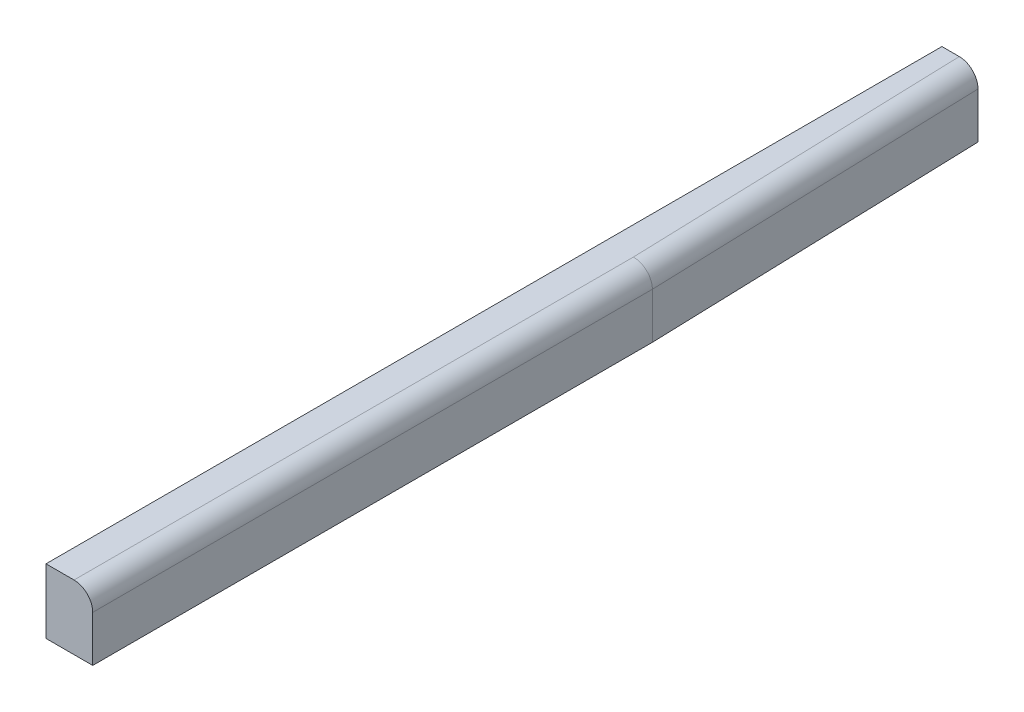
ISO-10303-21;
HEADER;
FILE_DESCRIPTION(('STEP AP214'),'2;1');
FILE_NAME('part.step','',(''),(''),'','','');
FILE_SCHEMA(('AUTOMOTIVE_DESIGN { 1 0 10303 214 1 1 1 1 }'));
ENDSEC;
DATA;
#1=APPLICATION_CONTEXT('core data for automotive mechanical design processes');
#2=APPLICATION_PROTOCOL_DEFINITION('international standard','automotive_design',2000,#1);
#3=PRODUCT_CONTEXT('',#1,'mechanical');
#4=PRODUCT('Part','Part','',(#3));
#5=PRODUCT_RELATED_PRODUCT_CATEGORY('part','',(#4));
#6=PRODUCT_DEFINITION_FORMATION('','',#4);
#7=PRODUCT_DEFINITION_CONTEXT('part definition',#1,'design');
#8=PRODUCT_DEFINITION('design','',#6,#7);
#9=PRODUCT_DEFINITION_SHAPE('','',#8);
#10=(LENGTH_UNIT() NAMED_UNIT(*) SI_UNIT(.MILLI.,.METRE.));
#11=(NAMED_UNIT(*) PLANE_ANGLE_UNIT() SI_UNIT($,.RADIAN.));
#12=(NAMED_UNIT(*) SI_UNIT($,.STERADIAN.) SOLID_ANGLE_UNIT());
#13=UNCERTAINTY_MEASURE_WITH_UNIT(LENGTH_MEASURE(1.E-05),#10,'distance_accuracy_value','');
#14=(GEOMETRIC_REPRESENTATION_CONTEXT(3) GLOBAL_UNCERTAINTY_ASSIGNED_CONTEXT((#13)) GLOBAL_UNIT_ASSIGNED_CONTEXT((#10,
#11,#12)) REPRESENTATION_CONTEXT('',''));
#15=CARTESIAN_POINT('',(0.,0.,0.));
#16=DIRECTION('',(0.,0.,1.));
#17=DIRECTION('',(1.,0.,0.));
#18=AXIS2_PLACEMENT_3D('',#15,#16,#17);
#19=CARTESIAN_POINT('',(37.211,37.211,25.4));
#20=DIRECTION('',(0.,0.,-1.));
#21=DIRECTION('',(-1.,0.,0.));
#22=AXIS2_PLACEMENT_3D('',#19,#20,#21);
#23=CYLINDRICAL_SURFACE('',#22,12.7);
#24=DIRECTION('',(0.,0.,-1.));
#25=VECTOR('',#24,1.);
#26=CARTESIAN_POINT('',(37.211,49.911,25.4));
#27=LINE('',#26,#25);
#28=CARTESIAN_POINT('',(37.211,49.911,24.511));
#29=VERTEX_POINT('',#28);
#30=CARTESIAN_POINT('',(37.211,49.911,-355.500431129882));
#31=VERTEX_POINT('',#30);
#32=EDGE_CURVE('E111',#29,#31,#27,.T.);
#33=ORIENTED_EDGE('',*,*,#32,.F.);
#34=CARTESIAN_POINT('',(37.211,37.211,24.511));
#35=DIRECTION('',(0.,0.,1.));
#36=DIRECTION('',(1.,0.,0.));
#37=AXIS2_PLACEMENT_3D('',#34,#35,#36);
#38=CIRCLE('',#37,12.7);
#39=CARTESIAN_POINT('',(49.911,37.211,24.511));
#40=VERTEX_POINT('',#39);
#41=EDGE_CURVE('E97',#29,#40,#38,.F.);
#42=ORIENTED_EDGE('',*,*,#41,.T.);
#43=DIRECTION('',(0.,0.,-1.));
#44=VECTOR('',#43,1.);
#45=CARTESIAN_POINT('',(49.911,37.211,25.4));
#46=LINE('',#45,#44);
#47=CARTESIAN_POINT('',(49.911,37.211,-355.7016));
#48=VERTEX_POINT('',#47);
#49=EDGE_CURVE('E129',#48,#40,#46,.F.);
#50=ORIENTED_EDGE('',*,*,#49,.F.);
#51=CARTESIAN_POINT('',(37.211,37.211,-355.50043112988));
#52=DIRECTION('',(-0.0158380816890187,0.,-0.999874569717828));
#53=DIRECTION('',(0.999874569717828,0.,-0.0158380816890164));
#54=AXIS2_PLACEMENT_3D('',#51,#52,#53);
#55=ELLIPSE('',#54,12.7015931644146,12.7);
#56=EDGE_CURVE('E118',#31,#48,#55,.T.);
#57=ORIENTED_EDGE('',*,*,#56,.F.);
#58=EDGE_LOOP('',(#33,#42,#50,#57));
#59=FACE_BOUND('',#58,.T.);
#60=ADVANCED_FACE('F43',(#59),#23,.T.);
#61=CARTESIAN_POINT('',(49.911,-49.911,25.4));
#62=DIRECTION('',(-1.,0.,0.));
#63=DIRECTION('',(0.,0.,1.));
#64=AXIS2_PLACEMENT_3D('',#61,#62,#63);
#65=PLANE('',#64);
#66=DIRECTION('',(0.,1.,0.));
#67=VECTOR('',#66,1.);
#68=CARTESIAN_POINT('',(49.911,-49.911,24.511));
#69=LINE('',#68,#67);
#70=CARTESIAN_POINT('',(49.911,5.96900000000002,24.511));
#71=VERTEX_POINT('',#70);
#72=EDGE_CURVE('E100',#71,#40,#69,.T.);
#73=ORIENTED_EDGE('',*,*,#72,.F.);
#74=DIRECTION('',(0.,0.,-1.));
#75=VECTOR('',#74,1.);
#76=CARTESIAN_POINT('',(49.911,5.96900000000002,25.4));
#77=LINE('',#76,#75);
#78=CARTESIAN_POINT('',(49.911,5.96900000000002,-355.7016));
#79=VERTEX_POINT('',#78);
#80=EDGE_CURVE('E132',#71,#79,#77,.T.);
#81=ORIENTED_EDGE('',*,*,#80,.T.);
#82=DIRECTION('',(0.,1.,0.));
#83=VECTOR('',#82,1.);
#84=CARTESIAN_POINT('',(49.911,-49.911,-355.7016));
#85=LINE('',#84,#83);
#86=EDGE_CURVE('E119',#79,#48,#85,.T.);
#87=ORIENTED_EDGE('',*,*,#86,.T.);
#88=ORIENTED_EDGE('',*,*,#49,.T.);
#89=EDGE_LOOP('',(#73,#81,#87,#88));
#90=FACE_BOUND('',#89,.T.);
#91=ADVANCED_FACE('F153',(#90),#65,.F.);
#92=CARTESIAN_POINT('',(0.,5.96900000000002,0.));
#93=DIRECTION('',(0.,1.,0.));
#94=DIRECTION('',(0.,0.,1.));
#95=AXIS2_PLACEMENT_3D('',#92,#93,#94);
#96=PLANE('',#95);
#97=DIRECTION('',(1.,0.,0.));
#98=VECTOR('',#97,1.);
#99=CARTESIAN_POINT('',(0.,5.96900000000002,24.511));
#100=LINE('',#99,#98);
#101=CARTESIAN_POINT('',(18.161,5.96900000000002,24.511));
#102=VERTEX_POINT('',#101);
#103=EDGE_CURVE('E114',#102,#71,#100,.T.);
#104=ORIENTED_EDGE('',*,*,#103,.F.);
#105=DIRECTION('',(0.,0.,1.));
#106=VECTOR('',#105,1.);
#107=CARTESIAN_POINT('',(18.161,5.96900000000002,0.));
#108=LINE('',#107,#106);
#109=CARTESIAN_POINT('',(18.161,5.96900000000002,-584.2));
#110=VERTEX_POINT('',#109);
#111=EDGE_CURVE('E134',#110,#102,#108,.T.);
#112=ORIENTED_EDGE('',*,*,#111,.F.);
#113=DIRECTION('',(1.,0.,0.));
#114=VECTOR('',#113,1.);
#115=CARTESIAN_POINT('',(0.,5.96900000000002,-584.2));
#116=LINE('',#115,#114);
#117=CARTESIAN_POINT('',(42.6703226354349,5.96900000000002,-584.2));
#118=VERTEX_POINT('',#117);
#119=EDGE_CURVE('E158',#110,#118,#116,.T.);
#120=ORIENTED_EDGE('',*,*,#119,.T.);
#121=DIRECTION('',(-0.0316721902279269,0.,-0.999498310336824));
#122=VECTOR('',#121,1.);
#123=CARTESIAN_POINT('',(61.1211296763861,5.96900000000002,-1.93681172447798));
#124=LINE('',#123,#122);
#125=EDGE_CURVE('E135',#79,#118,#124,.T.);
#126=ORIENTED_EDGE('',*,*,#125,.F.);
#127=ORIENTED_EDGE('',*,*,#80,.F.);
#128=EDGE_LOOP('',(#104,#112,#120,#126,#127));
#129=FACE_BOUND('',#128,.T.);
#130=ADVANCED_FACE('F155',(#129),#96,.F.);
#131=CARTESIAN_POINT('',(-49.911,49.911,25.4));
#132=DIRECTION('',(0.,-1.,0.));
#133=DIRECTION('',(0.,0.,-1.));
#134=AXIS2_PLACEMENT_3D('',#131,#132,#133);
#135=PLANE('',#134);
#136=DIRECTION('',(-1.,0.,0.));
#137=VECTOR('',#136,1.);
#138=CARTESIAN_POINT('',(-78.5898334013736,49.911,24.511));
#139=LINE('',#138,#137);
#140=CARTESIAN_POINT('',(18.161,49.911,24.511));
#141=VERTEX_POINT('',#140);
#142=EDGE_CURVE('E57',#29,#141,#139,.T.);
#143=ORIENTED_EDGE('',*,*,#142,.F.);
#144=ORIENTED_EDGE('',*,*,#32,.T.);
#145=DIRECTION('',(0.0316721902279269,0.,0.999498310336824));
#146=VECTOR('',#145,1.);
#147=CARTESIAN_POINT('',(49.1815040674601,49.911,22.2599480293983));
#148=LINE('',#147,#146);
#149=CARTESIAN_POINT('',(29.9639479786131,49.911,-584.2));
#150=VERTEX_POINT('',#149);
#151=EDGE_CURVE('E120',#31,#150,#148,.F.);
#152=ORIENTED_EDGE('',*,*,#151,.T.);
#153=DIRECTION('',(-1.,0.,0.));
#154=VECTOR('',#153,1.);
#155=CARTESIAN_POINT('',(-49.911,49.911,-584.2));
#156=LINE('',#155,#154);
#157=CARTESIAN_POINT('',(18.161,49.911,-584.2));
#158=VERTEX_POINT('',#157);
#159=EDGE_CURVE('E65',#150,#158,#156,.T.);
#160=ORIENTED_EDGE('',*,*,#159,.T.);
#161=DIRECTION('',(0.,0.,1.));
#162=VECTOR('',#161,1.);
#163=CARTESIAN_POINT('',(18.161,49.911,25.4));
#164=LINE('',#163,#162);
#165=EDGE_CURVE('E105',#158,#141,#164,.T.);
#166=ORIENTED_EDGE('',*,*,#165,.T.);
#167=EDGE_LOOP('',(#143,#144,#152,#160,#166));
#168=FACE_BOUND('',#167,.T.);
#169=ADVANCED_FACE('F109',(#168),#135,.F.);
#170=CARTESIAN_POINT('',(18.161,0.,0.));
#171=DIRECTION('',(1.,0.,0.));
#172=DIRECTION('',(0.,0.,-1.));
#173=AXIS2_PLACEMENT_3D('',#170,#171,#172);
#174=PLANE('',#173);
#175=DIRECTION('',(0.,-1.,0.));
#176=VECTOR('',#175,1.);
#177=CARTESIAN_POINT('',(18.161,0.,24.511));
#178=LINE('',#177,#176);
#179=EDGE_CURVE('E11',#141,#102,#178,.T.);
#180=ORIENTED_EDGE('',*,*,#179,.F.);
#181=ORIENTED_EDGE('',*,*,#165,.F.);
#182=DIRECTION('',(0.,-1.,0.));
#183=VECTOR('',#182,1.);
#184=CARTESIAN_POINT('',(18.161,0.,-584.2));
#185=LINE('',#184,#183);
#186=EDGE_CURVE('E165',#158,#110,#185,.T.);
#187=ORIENTED_EDGE('',*,*,#186,.T.);
#188=ORIENTED_EDGE('',*,*,#111,.T.);
#189=EDGE_LOOP('',(#180,#181,#187,#188));
#190=FACE_BOUND('',#189,.T.);
#191=ADVANCED_FACE('F168',(#190),#174,.F.);
#192=CARTESIAN_POINT('',(0.,0.,-584.2));
#193=DIRECTION('',(0.,0.,1.));
#194=DIRECTION('',(1.,0.,0.));
#195=AXIS2_PLACEMENT_3D('',#192,#193,#194);
#196=PLANE('',#195);
#197=CARTESIAN_POINT('',(29.9639479786131,37.211,-584.2));
#198=DIRECTION('',(0.,0.,1.));
#199=DIRECTION('',(1.,0.,0.));
#200=AXIS2_PLACEMENT_3D('',#197,#198,#199);
#201=ELLIPSE('',#200,12.7063746568218,12.7);
#202=CARTESIAN_POINT('',(42.6703226354349,37.211,-584.2));
#203=VERTEX_POINT('',#202);
#204=EDGE_CURVE('E51',#150,#203,#201,.F.);
#205=ORIENTED_EDGE('',*,*,#204,.T.);
#206=DIRECTION('',(0.,1.,0.));
#207=VECTOR('',#206,1.);
#208=CARTESIAN_POINT('',(42.6703226354349,0.,-584.2));
#209=LINE('',#208,#207);
#210=EDGE_CURVE('E138',#118,#203,#209,.T.);
#211=ORIENTED_EDGE('',*,*,#210,.F.);
#212=ORIENTED_EDGE('',*,*,#119,.F.);
#213=ORIENTED_EDGE('',*,*,#186,.F.);
#214=ORIENTED_EDGE('',*,*,#159,.F.);
#215=EDGE_LOOP('',(#205,#211,#212,#213,#214));
#216=FACE_BOUND('',#215,.T.);
#217=ADVANCED_FACE('F45',(#216),#196,.F.);
#218=CARTESIAN_POINT('',(48.4275011351085,37.211,-1.5345749085833));
#219=DIRECTION('',(0.0316721902279269,0.,0.999498310336824));
#220=DIRECTION('',(0.999498310336824,0.,-0.0316721902279269));
#221=AXIS2_PLACEMENT_3D('',#218,#219,#220);
#222=CYLINDRICAL_SURFACE('',#221,12.7);
#223=ORIENTED_EDGE('',*,*,#204,.F.);
#224=ORIENTED_EDGE('',*,*,#151,.F.);
#225=ORIENTED_EDGE('',*,*,#56,.T.);
#226=DIRECTION('',(0.0316721902279269,0.,0.999498310336824));
#227=VECTOR('',#226,1.);
#228=CARTESIAN_POINT('',(61.1211296763861,37.211,-1.93681172447798));
#229=LINE('',#228,#227);
#230=EDGE_CURVE('E124',#203,#48,#229,.T.);
#231=ORIENTED_EDGE('',*,*,#230,.F.);
#232=EDGE_LOOP('',(#223,#224,#225,#231));
#233=FACE_BOUND('',#232,.T.);
#234=ADVANCED_FACE('F164',(#233),#222,.T.);
#235=CARTESIAN_POINT('',(61.1211296763861,0.,-1.93681172447798));
#236=DIRECTION('',(-0.999498310336824,0.,0.0316721902279269));
#237=DIRECTION('',(0.0316721902279269,0.,0.999498310336824));
#238=AXIS2_PLACEMENT_3D('',#235,#236,#237);
#239=PLANE('',#238);
#240=ORIENTED_EDGE('',*,*,#125,.T.);
#241=ORIENTED_EDGE('',*,*,#210,.T.);
#242=ORIENTED_EDGE('',*,*,#230,.T.);
#243=ORIENTED_EDGE('',*,*,#86,.F.);
#244=EDGE_LOOP('',(#240,#241,#242,#243));
#245=FACE_BOUND('',#244,.T.);
#246=ADVANCED_FACE('F161',(#245),#239,.F.);
#247=CARTESIAN_POINT('',(0.,0.,24.511));
#248=DIRECTION('',(0.,0.,1.));
#249=DIRECTION('',(1.,0.,0.));
#250=AXIS2_PLACEMENT_3D('',#247,#248,#249);
#251=PLANE('',#250);
#252=ORIENTED_EDGE('',*,*,#142,.T.);
#253=ORIENTED_EDGE('',*,*,#179,.T.);
#254=ORIENTED_EDGE('',*,*,#103,.T.);
#255=ORIENTED_EDGE('',*,*,#72,.T.);
#256=ORIENTED_EDGE('',*,*,#41,.F.);
#257=EDGE_LOOP('',(#252,#253,#254,#255,#256));
#258=FACE_BOUND('',#257,.T.);
#259=ADVANCED_FACE('F98',(#258),#251,.T.);
#260=CLOSED_SHELL('',(#60,#91,#130,#169,#191,#217,#234,#246,#259));
#261=MANIFOLD_SOLID_BREP('B2',#260);
#262=ADVANCED_BREP_SHAPE_REPRESENTATION('',(#18,#261),#14);
#263=SHAPE_DEFINITION_REPRESENTATION(#9,#262);
ENDSEC;
END-ISO-10303-21;
